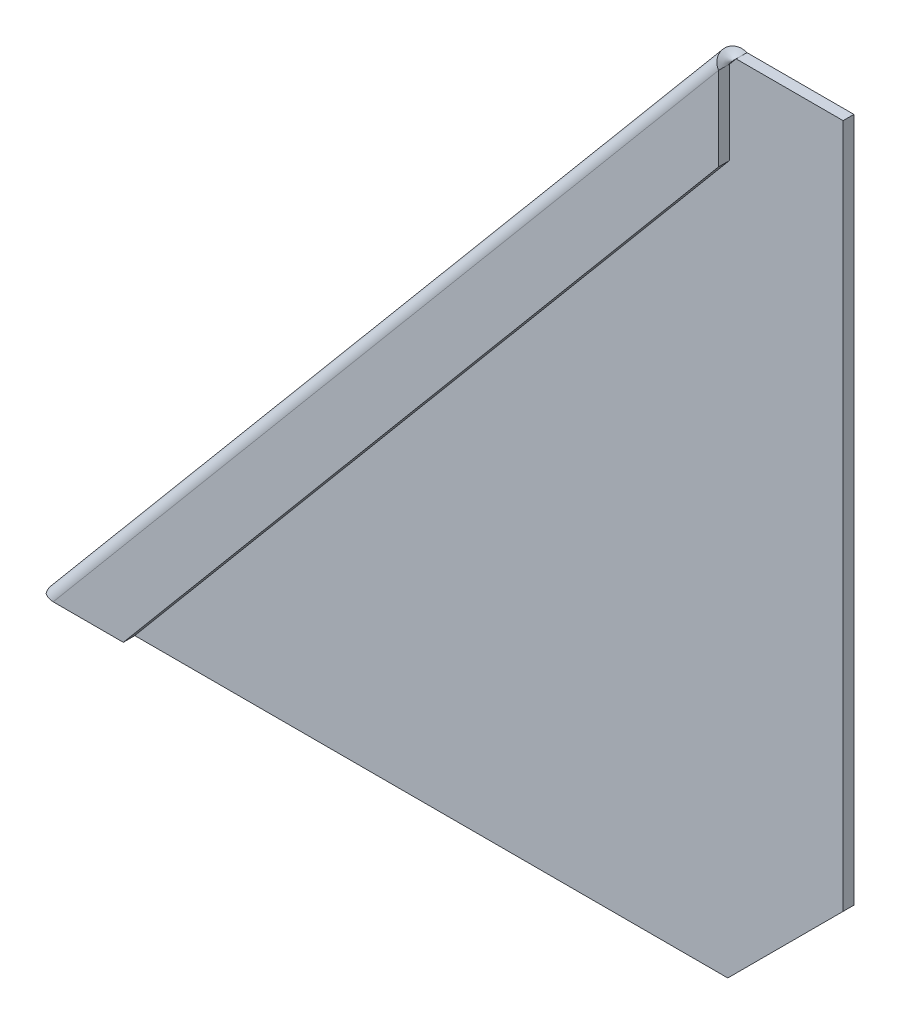
ISO-10303-21;
HEADER;
FILE_DESCRIPTION(('STEP AP214'),'2;1');
FILE_NAME('part.step','',(''),(''),'','','');
FILE_SCHEMA(('AUTOMOTIVE_DESIGN { 1 0 10303 214 1 1 1 1 }'));
ENDSEC;
DATA;
#1=APPLICATION_CONTEXT('core data for automotive mechanical design processes');
#2=APPLICATION_PROTOCOL_DEFINITION('international standard','automotive_design',2000,#1);
#3=PRODUCT_CONTEXT('',#1,'mechanical');
#4=PRODUCT('Part','Part','',(#3));
#5=PRODUCT_RELATED_PRODUCT_CATEGORY('part','',(#4));
#6=PRODUCT_DEFINITION_FORMATION('','',#4);
#7=PRODUCT_DEFINITION_CONTEXT('part definition',#1,'design');
#8=PRODUCT_DEFINITION('design','',#6,#7);
#9=PRODUCT_DEFINITION_SHAPE('','',#8);
#10=(LENGTH_UNIT() NAMED_UNIT(*) SI_UNIT(.MILLI.,.METRE.));
#11=(NAMED_UNIT(*) PLANE_ANGLE_UNIT() SI_UNIT($,.RADIAN.));
#12=(NAMED_UNIT(*) SI_UNIT($,.STERADIAN.) SOLID_ANGLE_UNIT());
#13=UNCERTAINTY_MEASURE_WITH_UNIT(LENGTH_MEASURE(1.E-05),#10,'distance_accuracy_value','');
#14=(GEOMETRIC_REPRESENTATION_CONTEXT(3) GLOBAL_UNCERTAINTY_ASSIGNED_CONTEXT((#13)) GLOBAL_UNIT_ASSIGNED_CONTEXT((#10,
#11,#12)) REPRESENTATION_CONTEXT('',''));
#15=CARTESIAN_POINT('',(0.,0.,0.));
#16=DIRECTION('',(0.,0.,1.));
#17=DIRECTION('',(1.,0.,0.));
#18=AXIS2_PLACEMENT_3D('',#15,#16,#17);
#19=CARTESIAN_POINT('',(53.4644295184103,49.7149115128211,1.6));
#20=DIRECTION('',(-0.766044443118975,0.642787609686543,0.));
#21=DIRECTION('',(-0.642787609686543,-0.766044443118975,0.));
#22=AXIS2_PLACEMENT_3D('',#19,#20,#21);
#23=PLANE('',#22);
#24=DIRECTION('',(0.,0.,1.));
#25=VECTOR('',#24,1.);
#26=CARTESIAN_POINT('',(94.3274279475135,98.4135366948759,-1.60248477930249));
#27=LINE('',#26,#25);
#28=CARTESIAN_POINT('',(94.3274279475135,98.4135366948759,0.1));
#29=VERTEX_POINT('',#28);
#30=CARTESIAN_POINT('',(94.3274279475135,98.4135366948759,1.6));
#31=VERTEX_POINT('',#30);
#32=EDGE_CURVE('E142',#29,#31,#27,.T.);
#33=ORIENTED_EDGE('',*,*,#32,.T.);
#34=DIRECTION('',(-0.642787609686543,-0.766044443118975,0.));
#35=VECTOR('',#34,1.);
#36=CARTESIAN_POINT('',(53.4644295184103,49.7149115128211,1.6));
#37=LINE('',#36,#35);
#38=CARTESIAN_POINT('',(11.7486656039906,0.,1.6));
#39=VERTEX_POINT('',#38);
#40=EDGE_CURVE('E132',#31,#39,#37,.T.);
#41=ORIENTED_EDGE('',*,*,#40,.T.);
#42=DIRECTION('',(0.,0.,1.));
#43=VECTOR('',#42,1.);
#44=CARTESIAN_POINT('',(11.7486656039906,0.,1.6));
#45=LINE('',#44,#43);
#46=CARTESIAN_POINT('',(11.7486656039906,0.,0.0999999999999998));
#47=VERTEX_POINT('',#46);
#48=EDGE_CURVE('E262',#39,#47,#45,.F.);
#49=ORIENTED_EDGE('',*,*,#48,.T.);
#50=DIRECTION('',(-0.642787609686543,-0.766044443118975,0.));
#51=VECTOR('',#50,1.);
#52=CARTESIAN_POINT('',(53.4644295184103,49.7149115128211,0.1));
#53=LINE('',#52,#51);
#54=EDGE_CURVE('E151',#29,#47,#53,.T.);
#55=ORIENTED_EDGE('',*,*,#54,.F.);
#56=EDGE_LOOP('',(#33,#41,#49,#55));
#57=FACE_BOUND('',#56,.T.);
#58=ADVANCED_FACE('F39',(#57),#23,.F.);
#59=CARTESIAN_POINT('',(50.6109139677921,52.1092953589035,1.6));
#60=DIRECTION('',(0.,0.,1.));
#61=DIRECTION('',(1.,0.,0.));
#62=AXIS2_PLACEMENT_3D('',#59,#60,#61);
#63=PLANE('',#62);
#64=DIRECTION('',(0.,-1.,0.));
#65=VECTOR('',#64,1.);
#66=CARTESIAN_POINT('',(94.3274279475135,110.003679204986,1.6));
#67=LINE('',#66,#65);
#68=CARTESIAN_POINT('',(94.3274279475135,110.003679204986,1.6));
#69=VERTEX_POINT('',#68);
#70=EDGE_CURVE('E126',#69,#31,#67,.T.);
#71=ORIENTED_EDGE('',*,*,#70,.F.);
#72=DIRECTION('',(0.642787609686543,0.766044443118975,0.));
#73=VECTOR('',#72,1.);
#74=CARTESIAN_POINT('',(47.757398417174,54.5036792049859,1.6));
#75=LINE('',#74,#73);
#76=CARTESIAN_POINT('',(2.02338129846503,0.,1.6));
#77=VERTEX_POINT('',#76);
#78=EDGE_CURVE('E140',#77,#69,#75,.T.);
#79=ORIENTED_EDGE('',*,*,#78,.F.);
#80=DIRECTION('',(1.,0.,0.));
#81=VECTOR('',#80,1.);
#82=CARTESIAN_POINT('',(11.7486656039906,0.,1.6));
#83=LINE('',#82,#81);
#84=EDGE_CURVE('E259',#77,#39,#83,.T.);
#85=ORIENTED_EDGE('',*,*,#84,.T.);
#86=ORIENTED_EDGE('',*,*,#40,.F.);
#87=EDGE_LOOP('',(#71,#79,#85,#86));
#88=FACE_BOUND('',#87,.T.);
#89=ADVANCED_FACE('F138',(#88),#63,.T.);
#90=CARTESIAN_POINT('',(50.6109139677921,52.1092953589035,0.1));
#91=DIRECTION('',(0.,0.,1.));
#92=DIRECTION('',(1.,0.,0.));
#93=AXIS2_PLACEMENT_3D('',#90,#91,#92);
#94=PLANE('',#93);
#95=DIRECTION('',(0.642787609686543,0.766044443118975,0.));
#96=VECTOR('',#95,1.);
#97=CARTESIAN_POINT('',(47.757398417174,54.5036792049859,0.1));
#98=LINE('',#97,#96);
#99=CARTESIAN_POINT('',(2.02338129846502,0.,0.0999999999999999));
#100=VERTEX_POINT('',#99);
#101=CARTESIAN_POINT('',(94.3274279475135,110.003679204986,0.1));
#102=VERTEX_POINT('',#101);
#103=EDGE_CURVE('E203',#100,#102,#98,.T.);
#104=ORIENTED_EDGE('',*,*,#103,.T.);
#105=DIRECTION('',(0.,1.,0.));
#106=VECTOR('',#105,1.);
#107=CARTESIAN_POINT('',(94.3274279475135,110.003679204986,0.1));
#108=LINE('',#107,#106);
#109=EDGE_CURVE('E141',#29,#102,#108,.T.);
#110=ORIENTED_EDGE('',*,*,#109,.F.);
#111=ORIENTED_EDGE('',*,*,#54,.T.);
#112=DIRECTION('',(1.,0.,0.));
#113=VECTOR('',#112,1.);
#114=CARTESIAN_POINT('',(50.6109139677922,0.,0.0999999999999996));
#115=LINE('',#114,#113);
#116=EDGE_CURVE('E258',#100,#47,#115,.T.);
#117=ORIENTED_EDGE('',*,*,#116,.F.);
#118=EDGE_LOOP('',(#104,#110,#111,#117));
#119=FACE_BOUND('',#118,.T.);
#120=ADVANCED_FACE('F297',(#119),#94,.F.);
#121=CARTESIAN_POINT('',(1.18736888683441,-0.996320795014147,1.615));
#122=CARTESIAN_POINT('',(1.06525189034624,-0.823098008175235,1.615));
#123=CARTESIAN_POINT('',(0.943237636036034,-0.64998547740429,1.57426723898592));
#124=CARTESIAN_POINT('',(0.722935862840768,-0.323645465662352,1.41747569777443));
#125=CARTESIAN_POINT('',(0.624782932955035,-0.17054294084322,1.30147860835318));
#126=CARTESIAN_POINT('',(0.472517606615515,0.0987077134354483,1.0117656167608));
#127=CARTESIAN_POINT('',(0.418492531330992,0.214782571734061,0.838163704280529));
#128=CARTESIAN_POINT('',(0.368050943427069,0.398592964646326,0.459635439022373));
#129=CARTESIAN_POINT('',(0.371681688683938,0.466288845193432,0.254858020952946));
#130=CARTESIAN_POINT('',(0.44134938965313,0.549315578111301,-0.154858020952702));
#131=CARTESIAN_POINT('',(0.507386345365461,0.564646430482059,-0.359635439022135));
#132=CARTESIAN_POINT('',(0.697163335207776,0.546889503405524,-0.738163704280317));
#133=CARTESIAN_POINT('',(0.820856111461497,0.513841378024773,-0.911765616760599));
#134=CARTESIAN_POINT('',(1.11245683973942,0.410644189581829,-1.20147860835303));
#135=CARTESIAN_POINT('',(1.28027747059436,0.340568397680551,-1.31747569777431));
#136=CARTESIAN_POINT('',(1.63991464572805,0.180281851774321,-1.47426723898586));
#137=CARTESIAN_POINT('',(1.83158476108518,0.090181943651314,-1.51499999999997));
#138=CARTESIAN_POINT('',(2.02338129846486,1.58081334632056E-13,-1.515));
#139=CARTESIAN_POINT('',(1.18736888683441,-0.996320795014147,1.6));
#140=CARTESIAN_POINT('',(1.06675621881271,-0.824360406856436,1.6));
#141=CARTESIAN_POINT('',(0.946245293720707,-0.652509201858207,1.55965764883589));
#142=CARTESIAN_POINT('',(0.728722780661203,-0.328501266271132,1.40436890194912));
#143=CARTESIAN_POINT('',(0.631844484453141,-0.17646828610082,1.28948360571721));
#144=CARTESIAN_POINT('',(0.481706311729999,0.0909974743628879,1.00254741596118));
#145=CARTESIAN_POINT('',(0.428532919440068,0.206357685774858,0.830609419574965));
#146=CARTESIAN_POINT('',(0.379242538777741,0.389202101115292,0.455709220756983));
#147=CARTESIAN_POINT('',(0.383172355330722,0.456647031048134,0.252894525544452));
#148=CARTESIAN_POINT('',(0.452840056299914,0.539673763966003,-0.15289452554421));
#149=CARTESIAN_POINT('',(0.518577940716134,0.555255566951024,-0.355709220756747));
#150=CARTESIAN_POINT('',(0.707203723316854,0.53846461744632,-0.730609419574755));
#151=CARTESIAN_POINT('',(0.830044816575982,0.506131138952212,-0.902547415960976));
#152=CARTESIAN_POINT('',(1.11951839123753,0.404718844324228,-1.18948360571706));
#153=CARTESIAN_POINT('',(1.2860643884148,0.335712597071769,-1.30436890194899));
#154=CARTESIAN_POINT('',(1.64292230341272,0.177758127320403,-1.45965764883583));
#155=CARTESIAN_POINT('',(1.83308920499064,0.0889196825449384,-1.49999999999997));
#156=CARTESIAN_POINT('',(2.02338129846486,1.56585135634026E-13,-1.5));
#157=CARTESIAN_POINT('',(1.18736888683441,-0.996320795014147,0.1));
#158=CARTESIAN_POINT('',(1.2171890654594,-0.950600274976489,0.1));
#159=CARTESIAN_POINT('',(1.24701106218805,-0.904881647249911,0.098698633833416));
#160=CARTESIAN_POINT('',(1.30741456270473,-0.814081327149187,0.0936893194177136));
#161=CARTESIAN_POINT('',(1.33799963426377,-0.769002811860864,0.08998334211991));
#162=CARTESIAN_POINT('',(1.4005768231784,-0.680026432893152,0.0807273359987476));
#163=CARTESIAN_POINT('',(1.4325717303477,-0.636130910145421,0.0751809490185473));
#164=CARTESIAN_POINT('',(1.49840207384494,-0.549884251988137,0.0630873942179672));
#165=CARTESIAN_POINT('',(1.53223902000917,-0.507534383481668,0.0565449846949823));
#166=CARTESIAN_POINT('',(1.60190672097839,-0.424507650563822,0.0434550153050255));
#167=CARTESIAN_POINT('',(1.63773747578338,-0.383830786152444,0.0369126057820405));
#168=CARTESIAN_POINT('',(1.71124253422458,-0.304023978474036,0.0248190509814596));
#169=CARTESIAN_POINT('',(1.7489153280245,-0.26489276830392,0.0192726640012587));
#170=CARTESIAN_POINT('',(1.82567354104831,-0.18781568143594,0.0100166578800948));
#171=CARTESIAN_POINT('',(1.86475617045849,-0.149867463806417,0.00631068058229042));
#172=CARTESIAN_POINT('',(1.94368807188024,-0.0746143180714487,0.00130136616658613));
#173=CARTESIAN_POINT('',(1.98353359553614,-0.0373064280926161,0.));
#174=CARTESIAN_POINT('',(2.02338129846504,0.,0.));
#175=B_SPLINE_SURFACE_WITH_KNOTS('',1,3,((#121,#122,#123,#124,#125,#126,#127,#128,#129,#130,
#131,#132,#133,#134,#135,#136,#137,#138),(#139,#140,#141,#142,#143,#144,#145,#146,#147,#148,
#149,#150,#151,#152,#153,#154,#155,#156),(#157,#158,#159,#160,#161,#162,#163,#164,#165,#166,
#167,#168,#169,#170,#171,#172,#173,#174)),.UNSPECIFIED.,.F.,.F.,.F.,(2,1,2),(4,2,2,2,2,2,2,2,4),
(-0.01,0.,1.),(0.,0.125,0.25,0.375,0.5,0.625,0.75,0.875,1.),.UNSPECIFIED.);
#176=CARTESIAN_POINT('',(1.18736888683441,-0.996320795014147,0.1));
#177=CARTESIAN_POINT('',(1.21716880831438,-0.950583460584059,0.100065775890201));
#178=CARTESIAN_POINT('',(1.24700485282516,-0.904876436975799,0.0987159274405331));
#179=CARTESIAN_POINT('',(1.30742077206762,-0.814086537423298,0.0936720258105964));
#180=CARTESIAN_POINT('',(1.33800064679931,-0.769003661479057,0.089977972630328));
#181=CARTESIAN_POINT('',(1.40057581064287,-0.680025583274959,0.0807327054883296));
#182=CARTESIAN_POINT('',(1.43257109975474,-0.636130381015102,0.0751814915265998));
#183=CARTESIAN_POINT('',(1.4984027044379,-0.549884781118456,0.0630868517099146));
#184=CARTESIAN_POINT('',(1.53223902000917,-0.507534383481668,0.0565434258549593));
#185=CARTESIAN_POINT('',(1.60190672097839,-0.424507650563822,0.0434565741450485));
#186=CARTESIAN_POINT('',(1.63773810637633,-0.383831315282764,0.036913148290093));
#187=CARTESIAN_POINT('',(1.71124190363162,-0.304023449343716,0.0248185084734071));
#188=CARTESIAN_POINT('',(1.74891431548896,-0.264891918685727,0.0192672945116766));
#189=CARTESIAN_POINT('',(1.82567455358384,-0.187816531054133,0.0100220273696769));
#190=CARTESIAN_POINT('',(1.86476237982138,-0.149872674080528,0.00632797418940756));
#191=CARTESIAN_POINT('',(1.94368186251735,-0.0746091077973372,0.00128407255946899));
#192=CARTESIAN_POINT('',(1.98351351897579,-0.0372893984877515,-6.57758902002627E-05));
#193=CARTESIAN_POINT('',(2.02338129846504,0.,0.));
#194=B_SPLINE_CURVE_WITH_KNOTS('',3,(#176,#177,#178,#179,#180,#181,#182,#183,#184,#185,#186,
#187,#188,#189,#190,#191,#192,#193),.UNSPECIFIED.,.F.,.F.,(4,2,2,2,2,2,2,2,4),(0.,
0.16374190956037,0.327483819120739,0.491225728681109,0.654967638241479,0.818709547801848,
0.982451457362218,1.14619336692259,1.30993527648296),.UNSPECIFIED.);
#195=CARTESIAN_POINT('',(1.3794621678111,-0.71010461708493,0.0838227237777744));
#196=VERTEX_POINT('',#195);
#197=CARTESIAN_POINT('',(2.02338129846505,0.,0.));
#198=VERTEX_POINT('',#197);
#199=EDGE_CURVE('E194',#196,#198,#194,.T.);
#200=DIRECTION('',(-0.564179819018901,0.47340307805643,0.67645447555508));
#201=VECTOR('',#200,1.);
#202=CARTESIAN_POINT('',(0.952095954904266,-0.35150178545685,0.596236989010723));
#203=LINE('',#202,#201);
#204=CARTESIAN_POINT('',(0.533192439282753,0.,1.09850443711034));
#205=VERTEX_POINT('',#204);
#206=EDGE_CURVE('E58',#196,#205,#203,.T.);
#207=CARTESIAN_POINT('',(1.18736888683441,-0.996320795014147,1.6));
#208=CARTESIAN_POINT('',(1.15941476798433,-0.956464135635271,1.59999971308944));
#209=CARTESIAN_POINT('',(1.13147488079028,-0.916629199740768,1.59785762616922));
#210=CARTESIAN_POINT('',(1.07589293205603,-0.837210384803298,1.58931558930324));
#211=CARTESIAN_POINT('',(1.0482508633581,-0.797626499736061,1.58291574192088));
#212=CARTESIAN_POINT('',(0.96629097710458,-0.679729094786784,1.55740461058176));
#213=CARTESIAN_POINT('',(0.912817023843812,-0.602096742933984,1.53198147631382));
#214=CARTESIAN_POINT('',(0.812572985790885,-0.453759036578622,1.46645399527575));
#215=CARTESIAN_POINT('',(0.765622659865016,-0.382901565405351,1.42696170206043));
#216=CARTESIAN_POINT('',(0.677929641163344,-0.246401544498451,1.33442145284099));
#217=CARTESIAN_POINT('',(0.637185206257785,-0.180757533717667,1.28137731237403));
#218=CARTESIAN_POINT('',(0.563615032985721,-0.0561103216146183,1.16334252457802));
#219=CARTESIAN_POINT('',(0.530789540056217,0.00289267384804367,1.0983515070815));
#220=CARTESIAN_POINT('',(0.474514283332714,0.113032702330246,0.958386142075318));
#221=CARTESIAN_POINT('',(0.451066211442278,0.164168314868909,0.883409996267558));
#222=CARTESIAN_POINT('',(0.4147466558964,0.25756749023924,0.725771029705138));
#223=CARTESIAN_POINT('',(0.401874558277994,0.299831567980636,0.64310865546631));
#224=CARTESIAN_POINT('',(0.387562983878634,0.374760752554453,0.472612382017508));
#225=CARTESIAN_POINT('',(0.38612275950006,0.40742648694462,0.384778821360362));
#226=CARTESIAN_POINT('',(0.395191655751465,0.462734777179185,0.20660554292085));
#227=CARTESIAN_POINT('',(0.405701140238716,0.485377027788866,0.116265748907778));
#228=CARTESIAN_POINT('',(0.438819702907601,0.520507860795771,-0.064170124234897));
#229=CARTESIAN_POINT('',(0.461428808451371,0.532996420231231,-0.154266202812897));
#230=CARTESIAN_POINT('',(0.518529639915988,0.548001446893185,-0.331470939227272));
#231=CARTESIAN_POINT('',(0.553021020469335,0.550518203931239,-0.41857968381191));
#232=CARTESIAN_POINT('',(0.63331162793968,0.546066881211348,-0.587166947608949));
#233=CARTESIAN_POINT('',(0.679111470171613,0.539098285244141,-0.668645160144515));
#234=CARTESIAN_POINT('',(0.781096200650439,0.516445018915251,-0.823491481301547));
#235=CARTESIAN_POINT('',(0.837281520131974,0.500759986567982,-0.89685925295214));
#236=CARTESIAN_POINT('',(0.958791887855717,0.461720666548431,-1.0332379839442));
#237=CARTESIAN_POINT('',(1.02411568034802,0.438367431997972,-1.09625036367387));
#238=CARTESIAN_POINT('',(1.16239225909434,0.385255448135228,-1.21001564554101));
#239=CARTESIAN_POINT('',(1.23534509652128,0.355496655855318,-1.26076846543815));
#240=CARTESIAN_POINT('',(1.38713634769567,0.291046644652834,-1.34847454455524));
#241=CARTESIAN_POINT('',(1.46597549960096,0.256354806619502,-1.38542606956062));
#242=CARTESIAN_POINT('',(1.62382815810242,0.18534968120767,-1.4430102666123));
#243=CARTESIAN_POINT('',(1.70265886710051,0.149189524044041,-1.4643290556288));
#244=CARTESIAN_POINT('',(1.82221184480131,0.0938319743023065,-1.48570209712041));
#245=CARTESIAN_POINT('',(1.86230351856722,0.0751824606673523,-1.49105894436943));
#246=CARTESIAN_POINT('',(1.94271814956082,0.0376911654979252,-1.49820813543985));
#247=CARTESIAN_POINT('',(1.98304112523137,0.0188493685357221,-1.50000019094614));
#248=CARTESIAN_POINT('',(2.02338129846486,1.56585135634026E-13,-1.5));
#249=B_SPLINE_CURVE_WITH_KNOTS('',3,(#207,#208,#209,#210,#211,#212,#213,#214,#215,#216,#217,
#218,#219,#220,#221,#222,#223,#224,#225,#226,#227,#228,#229,#230,#231,#232,#233,#234,#235,#236,
#237,#238,#239,#240,#241,#242,#243,#244,#245,#246,#247,#248),.UNSPECIFIED.,.F.,.F.,(4,2,2,2,2,2,
2,2,2,2,2,2,2,2,2,2,2,2,2,2,4),(0.,0.145948887948322,0.291894260322407,0.583157694214587,
0.863047563537065,1.14285871624387,1.42267854020877,1.70254882738755,1.98240286621607,
2.26223860358758,2.5420828619194,2.82192775309496,3.10176451104882,3.38161649881036,
3.66148010943616,3.94130530071905,4.2211323690904,4.50099458757257,4.76768679063459,
4.90118278071994,5.03468956732584),.UNSPECIFIED.);
#250=CARTESIAN_POINT('',(2.02338129846505,0.,-1.5));
#251=VERTEX_POINT('',#250);
#252=EDGE_CURVE('E65',#205,#251,#249,.T.);
#253=DIRECTION('',(-1.49772966992418E-13,1.25674441363666E-13,-1.));
#254=VECTOR('',#253,1.);
#255=CARTESIAN_POINT('',(2.02338129846504,0.,0.));
#256=LINE('',#255,#254);
#257=EDGE_CURVE('E158',#198,#251,#256,.T.);
#258=ORIENTED_EDGE('',*,*,#199,.F.);
#259=ORIENTED_EDGE('',*,*,#206,.T.);
#260=ORIENTED_EDGE('',*,*,#252,.T.);
#261=ORIENTED_EDGE('',*,*,#257,.F.);
#262=EDGE_LOOP('',(#258,#259,#260,#261));
#263=FACE_BOUND('',#262,.T.);
#264=ADVANCED_FACE('F185',(#263),#175,.F.);
#265=CARTESIAN_POINT('',(1.18736888683441,-0.996320795014147,0.05));
#266=DIRECTION('',(-0.642787609686543,-0.766044443118975,0.));
#267=DIRECTION('',(0.,0.,1.));
#268=AXIS2_PLACEMENT_3D('',#265,#266,#267);
#269=CYLINDRICAL_SURFACE('',#268,1.55);
#270=ORIENTED_EDGE('',*,*,#252,.F.);
#271=CARTESIAN_POINT('',(0.533192439282686,0.,1.09850443711042));
#272=CARTESIAN_POINT('',(0.581192019908546,0.00659518528979246,1.1339318719205));
#273=CARTESIAN_POINT('',(0.63046126397529,0.0121238884435424,1.167835289511));
#274=CARTESIAN_POINT('',(0.731308594351757,0.021252705379318,1.23233019725133));
#275=CARTESIAN_POINT('',(0.782887195859991,0.0248523864661467,1.26292094311538));
#276=CARTESIAN_POINT('',(0.887956345392533,0.0303172344491652,1.32043129823248));
#277=CARTESIAN_POINT('',(0.941441245461794,0.0321871440672115,1.34736077183084));
#278=CARTESIAN_POINT('',(1.05017417383933,0.0344352538465232,1.39740757189178));
#279=CARTESIAN_POINT('',(1.10542167890793,0.0348138926221636,1.42052601734148));
#280=CARTESIAN_POINT('',(1.22904946894692,0.0342575153375243,1.46714675754487));
#281=CARTESIAN_POINT('',(1.2977761907363,0.0330336334628605,1.48973343476685));
#282=CARTESIAN_POINT('',(1.43687984897719,0.0291761565526624,1.52878073872201));
#283=CARTESIAN_POINT('',(1.50725621086338,0.0265430455717221,1.54524346567502));
#284=CARTESIAN_POINT('',(1.65155791781921,0.0202100363518141,1.57229425123314));
#285=CARTESIAN_POINT('',(1.72552274878751,0.0164770383310525,1.58266454088114));
#286=CARTESIAN_POINT('',(1.87411820133748,0.00849577448107816,1.59652846015103));
#287=CARTESIAN_POINT('',(1.94874925031606,0.0042471519820581,1.60001730059705));
#288=CARTESIAN_POINT('',(2.02338129846506,0.,1.6));
#289=B_SPLINE_CURVE_WITH_KNOTS('',3,(#271,#272,#273,#274,#275,#276,#277,#278,#279,#280,#281,
#282,#283,#284,#285,#286,#287,#288),.UNSPECIFIED.,.F.,.F.,(4,2,2,2,2,2,2,2,4),(0.,
0.180020282607949,0.360080928332126,0.53964640408614,0.719159061880484,0.935918114861783,
1.1526027612485,1.37662367321431,1.60080043861841),.UNSPECIFIED.);
#290=EDGE_CURVE('E150',#205,#77,#289,.T.);
#291=ORIENTED_EDGE('',*,*,#290,.T.);
#292=ORIENTED_EDGE('',*,*,#78,.T.);
#293=CARTESIAN_POINT('',(95.1634403591441,111.,-1.5));
#294=CARTESIAN_POINT('',(95.1193350301824,111.020608396703,-1.49999971308944));
#295=CARTESIAN_POINT('',(95.0752535659775,111.041206550204,-1.49785762616925));
#296=CARTESIAN_POINT('',(94.9873895971837,111.082153151759,-1.48931558930337));
#297=CARTESIAN_POINT('',(94.943607085419,111.102501605815,-1.48291574192109));
#298=CARTESIAN_POINT('',(94.813268622076,111.162743667712,-1.45740461058228));
#299=CARTESIAN_POINT('',(94.7275300255509,111.20192451504,-1.43198147631465));
#300=CARTESIAN_POINT('',(94.5640387077386,111.274887048519,-1.36645399527717));
#301=CARTESIAN_POINT('',(94.4861048822304,111.308819822754,-1.32696170206202));
#302=CARTESIAN_POINT('',(94.3364508704632,111.371477607575,-1.23442145284293));
#303=CARTESIAN_POINT('',(94.2647289428359,111.400204080115,-1.18137731237613));
#304=CARTESIAN_POINT('',(94.129200075446,111.451011795911,-1.06334252458044));
#305=CARTESIAN_POINT('',(94.0653933810351,111.473092833206,-0.998351507084057));
#306=CARTESIAN_POINT('',(93.9471545312908,111.509387527096,-0.858386142078131));
#307=CARTESIAN_POINT('',(93.892724068654,111.523599764156,-0.783409996270484));
#308=CARTESIAN_POINT('',(93.7944370119899,111.543148947445,-0.62577102970827));
#309=CARTESIAN_POINT('',(93.7505798042619,111.548486408897,-0.543108655469533));
#310=CARTESIAN_POINT('',(93.6743037835524,111.549569241968,-0.372612382020862));
#311=CARTESIAN_POINT('',(93.6418842227282,111.545315240853,-0.284778821363755));
#312=CARTESIAN_POINT('',(93.5889909870066,111.526779937705,-0.106605542924295));
#313=CARTESIAN_POINT('',(93.5685176758899,111.512498330345,-0.0162657489112341));
#314=CARTESIAN_POINT('',(93.539671537229,111.473782507929,0.164170124231445));
#315=CARTESIAN_POINT('',(93.5312987370492,111.449348269913,0.254266202809462));
#316=CARTESIAN_POINT('',(93.5264371257851,111.390509332848,0.431470939223913));
#317=CARTESIAN_POINT('',(93.5299479693197,111.356104923594,0.51857968380861));
#318=CARTESIAN_POINT('',(93.5482739841162,111.277807074941,0.687166947605795));
#319=CARTESIAN_POINT('',(93.5630897705932,111.233913119215,0.768645160141449));
#320=CARTESIAN_POINT('',(93.6031083455022,111.137411464367,0.923491481298686));
#321=CARTESIAN_POINT('',(93.6283115653035,111.08480340342,0.996859252949398));
#322=CARTESIAN_POINT('',(93.6878578442537,110.971918157994,1.13323798394172));
#323=CARTESIAN_POINT('',(93.7221996482213,110.911642027314,1.19625036367152));
#324=CARTESIAN_POINT('',(93.7985162176203,110.784688979714,1.31001564553898));
#325=CARTESIAN_POINT('',(93.8404910342526,110.718012019861,1.3607684654363));
#326=CARTESIAN_POINT('',(93.9303201791187,110.579718445861,1.44847454455374));
#327=CARTESIAN_POINT('',(93.9781752452372,110.508101212278,1.4854260695593));
#328=CARTESIAN_POINT('',(94.0755124697353,110.364976600985,1.54301026661158));
#329=CARTESIAN_POINT('',(94.1248120818223,110.293622652983,1.56432905562839));
#330=CARTESIAN_POINT('',(94.2000887827088,110.18549869128,1.58570209712029));
#331=CARTESIAN_POINT('',(94.2254168144157,110.149254554181,1.59105894436937));
#332=CARTESIAN_POINT('',(94.2763023866992,110.076571897206,1.59820813543987));
#333=CARTESIAN_POINT('',(94.3018599456718,110.040133361848,1.60000019094616));
#334=CARTESIAN_POINT('',(94.327427947514,110.003679204985,1.6));
#335=B_SPLINE_CURVE_WITH_KNOTS('',3,(#293,#294,#295,#296,#297,#298,#299,#300,#301,#302,#303,
#304,#305,#306,#307,#308,#309,#310,#311,#312,#313,#314,#315,#316,#317,#318,#319,#320,#321,#322,
#323,#324,#325,#326,#327,#328,#329,#330,#331,#332,#333,#334),.UNSPECIFIED.,.F.,.F.,(4,2,2,2,2,2,
2,2,2,2,2,2,2,2,2,2,2,2,2,2,4),(0.,0.14594888794743,0.29189426032062,0.583157694211031,
0.863047563533527,1.14285871624031,1.4226785402052,1.70254882738396,1.98240286621249,
2.262238603584,2.54208286191581,2.82192775309137,3.10176451104524,3.38161649880678,
3.66148010943257,3.94130530071544,4.22113236908679,4.50099458756896,4.76768679063319,
4.90118278071966,5.03468956732666),.UNSPECIFIED.);
#336=CARTESIAN_POINT('',(95.163440359144,111.,-1.5));
#337=VERTEX_POINT('',#336);
#338=EDGE_CURVE('E149',#337,#69,#335,.T.);
#339=ORIENTED_EDGE('',*,*,#338,.F.);
#340=DIRECTION('',(-0.642787609686543,-0.766044443118975,0.));
#341=VECTOR('',#340,1.);
#342=CARTESIAN_POINT('',(1.18736888683425,-0.996320795014009,-1.5));
#343=LINE('',#342,#341);
#344=EDGE_CURVE('E159',#251,#337,#343,.F.);
#345=ORIENTED_EDGE('',*,*,#344,.F.);
#346=EDGE_LOOP('',(#270,#291,#292,#339,#345));
#347=FACE_BOUND('',#346,.T.);
#348=ADVANCED_FACE('F147',(#347),#269,.T.);
#349=CARTESIAN_POINT('',(1.18736888683441,-0.996320795014147,0.05));
#350=DIRECTION('',(-0.642787609686543,-0.766044443118975,0.));
#351=DIRECTION('',(0.,0.,1.));
#352=AXIS2_PLACEMENT_3D('',#349,#350,#351);
#353=CYLINDRICAL_SURFACE('',#352,0.05);
#354=CARTESIAN_POINT('',(1.37946216781117,-0.71010461708467,0.0838227237776491));
#355=CARTESIAN_POINT('',(1.40601031444282,-0.68028045204321,0.0850931984389044));
#356=CARTESIAN_POINT('',(1.4326091541581,-0.650498823549535,0.0863028086490816));
#357=CARTESIAN_POINT('',(1.48589735340459,-0.591011521706341,0.0885884849516076));
#358=CARTESIAN_POINT('',(1.5125867129358,-0.561305848356822,0.0896645510439564));
#359=CARTESIAN_POINT('',(1.56604508546278,-0.501961338850524,0.0916713238951531));
#360=CARTESIAN_POINT('',(1.59281409845856,-0.472322502693746,0.092602030654001));
#361=CARTESIAN_POINT('',(1.64641979965283,-0.413101616617836,0.0943082101035943));
#362=CARTESIAN_POINT('',(1.67325648785133,-0.383519566698702,0.0950836827943397));
#363=CARTESIAN_POINT('',(1.72698490743544,-0.32440165357844,0.0964710679167235));
#364=CARTESIAN_POINT('',(1.75387663882105,-0.294865790377312,0.0970829803483618));
#365=CARTESIAN_POINT('',(1.80770190232695,-0.235829138956108,0.0981367326681953));
#366=CARTESIAN_POINT('',(1.83463543444724,-0.206328350736034,0.0985785725563904));
#367=CARTESIAN_POINT('',(1.8885306255477,-0.147350375533626,0.0992873435510736));
#368=CARTESIAN_POINT('',(1.91549228452785,-0.117873188551292,0.0995542746575617));
#369=CARTESIAN_POINT('',(1.96942971284979,-0.058930654585855,0.0999107735019461));
#370=CARTESIAN_POINT('',(1.99640548219157,-0.0294653076027522,0.100000341239842));
#371=CARTESIAN_POINT('',(2.02338129846504,0.,0.1));
#372=B_SPLINE_CURVE_WITH_KNOTS('',3,(#354,#355,#356,#357,#358,#359,#360,#361,#362,#363,#364,
#365,#366,#367,#368,#369,#370,#371),.UNSPECIFIED.,.F.,.F.,(4,2,2,2,2,2,2,2,4),(0.,
0.119846010347673,0.239692020695346,0.35953803104302,0.479384041390693,0.599230051738367,
0.71907606208604,0.838922072433713,0.958768082781386),.UNSPECIFIED.);
#373=EDGE_CURVE('E261',#196,#100,#372,.T.);
#374=ORIENTED_EDGE('',*,*,#373,.F.);
#375=ORIENTED_EDGE('',*,*,#199,.T.);
#376=DIRECTION('',(-0.642787609686543,-0.766044443118975,0.));
#377=VECTOR('',#376,1.);
#378=CARTESIAN_POINT('',(1.18736888683441,-0.996320795014142,0.));
#379=LINE('',#378,#377);
#380=CARTESIAN_POINT('',(95.1634403591442,111.,0.));
#381=VERTEX_POINT('',#380);
#382=EDGE_CURVE('E196',#198,#381,#379,.F.);
#383=ORIENTED_EDGE('',*,*,#382,.T.);
#384=CARTESIAN_POINT('',(95.1634403591441,111.,0.));
#385=CARTESIAN_POINT('',(95.1235725796549,110.962710601512,-6.57758902000603E-05));
#386=CARTESIAN_POINT('',(95.0837409231964,110.925390892203,0.00128407255946809));
#387=CARTESIAN_POINT('',(95.0048214405005,110.850127325919,0.00632797418940491));
#388=CARTESIAN_POINT('',(94.9657336142629,110.812183468946,0.0100220273696739));
#389=CARTESIAN_POINT('',(94.888973376168,110.735108081314,0.0192672945116751));
#390=CARTESIAN_POINT('',(94.8513009643107,110.695976550656,0.0248185084734067));
#391=CARTESIAN_POINT('',(94.7777971670554,110.616168684717,0.0369131482900946));
#392=CARTESIAN_POINT('',(94.7419657816575,110.575492349436,0.043456574145051));
#393=CARTESIAN_POINT('',(94.6722980806883,110.492465616518,0.0565434258549631));
#394=CARTESIAN_POINT('',(94.638461765117,110.450115218882,0.0630868517099189));
#395=CARTESIAN_POINT('',(94.5726301604338,110.363869618985,0.0751814915266052));
#396=CARTESIAN_POINT('',(94.540634871322,110.319974416725,0.0807327054883359));
#397=CARTESIAN_POINT('',(94.4780597074784,110.230996338521,0.0899779726303345));
#398=CARTESIAN_POINT('',(94.4474798327467,110.185913462577,0.093672025810602));
#399=CARTESIAN_POINT('',(94.3870639135042,110.095123563024,0.0987159274405359));
#400=CARTESIAN_POINT('',(94.3572278689935,110.049416539416,0.100065775890202));
#401=CARTESIAN_POINT('',(94.3274279475135,110.003679204986,0.1));
#402=B_SPLINE_CURVE_WITH_KNOTS('',3,(#384,#385,#386,#387,#388,#389,#390,#391,#392,#393,#394,
#395,#396,#397,#398,#399,#400,#401),.UNSPECIFIED.,.F.,.F.,(4,2,2,2,2,2,2,2,4),(0.,
0.163741909560372,0.327483819120766,0.491225728681118,0.654967638241489,0.818709547801866,
0.982451457362216,1.1461933669226,1.30993527648298),.UNSPECIFIED.);
#403=EDGE_CURVE('E218',#381,#102,#402,.T.);
#404=ORIENTED_EDGE('',*,*,#403,.T.);
#405=ORIENTED_EDGE('',*,*,#103,.F.);
#406=EDGE_LOOP('',(#374,#375,#383,#404,#405));
#407=FACE_BOUND('',#406,.T.);
#408=ADVANCED_FACE('F184',(#407),#353,.F.);
#409=CARTESIAN_POINT('',(94.,0.,-1.5));
#410=DIRECTION('',(0.,-1.,0.));
#411=DIRECTION('',(1.,0.,0.));
#412=AXIS2_PLACEMENT_3D('',#409,#410,#411);
#413=PLANE('',#412);
#414=DIRECTION('',(1.,0.,0.));
#415=VECTOR('',#414,1.);
#416=CARTESIAN_POINT('',(94.,0.,0.));
#417=LINE('',#416,#415);
#418=CARTESIAN_POINT('',(94.,0.,0.));
#419=VERTEX_POINT('',#418);
#420=EDGE_CURVE('E217',#198,#419,#417,.T.);
#421=ORIENTED_EDGE('',*,*,#420,.F.);
#422=ORIENTED_EDGE('',*,*,#257,.T.);
#423=DIRECTION('',(1.,0.,0.));
#424=VECTOR('',#423,1.);
#425=CARTESIAN_POINT('',(94.,0.,-1.5));
#426=LINE('',#425,#424);
#427=CARTESIAN_POINT('',(94.,0.,-1.5));
#428=VERTEX_POINT('',#427);
#429=EDGE_CURVE('E221',#251,#428,#426,.T.);
#430=ORIENTED_EDGE('',*,*,#429,.T.);
#431=DIRECTION('',(0.,0.,1.));
#432=VECTOR('',#431,1.);
#433=CARTESIAN_POINT('',(94.,0.,-1.5));
#434=LINE('',#433,#432);
#435=EDGE_CURVE('E213',#428,#419,#434,.T.);
#436=ORIENTED_EDGE('',*,*,#435,.T.);
#437=EDGE_LOOP('',(#421,#422,#430,#436));
#438=FACE_BOUND('',#437,.T.);
#439=ADVANCED_FACE('F41',(#438),#413,.T.);
#440=CARTESIAN_POINT('',(93.1400590606791,111.,-1.5));
#441=DIRECTION('',(0.,1.,0.));
#442=DIRECTION('',(0.,0.,1.));
#443=AXIS2_PLACEMENT_3D('',#440,#441,#442);
#444=PLANE('',#443);
#445=DIRECTION('',(-1.49772966992418E-13,1.25674441363666E-13,-1.));
#446=VECTOR('',#445,1.);
#447=CARTESIAN_POINT('',(95.1634403591443,111.,0.));
#448=LINE('',#447,#446);
#449=EDGE_CURVE('E157',#381,#337,#448,.T.);
#450=ORIENTED_EDGE('',*,*,#449,.F.);
#451=DIRECTION('',(-1.,0.,0.));
#452=VECTOR('',#451,1.);
#453=CARTESIAN_POINT('',(93.1400590606791,111.,0.));
#454=LINE('',#453,#452);
#455=CARTESIAN_POINT('',(110.,111.,0.));
#456=VERTEX_POINT('',#455);
#457=EDGE_CURVE('E224',#456,#381,#454,.T.);
#458=ORIENTED_EDGE('',*,*,#457,.F.);
#459=DIRECTION('',(0.,0.,1.));
#460=VECTOR('',#459,1.);
#461=CARTESIAN_POINT('',(110.,111.,-1.5));
#462=LINE('',#461,#460);
#463=CARTESIAN_POINT('',(110.,111.,-1.5));
#464=VERTEX_POINT('',#463);
#465=EDGE_CURVE('E11',#464,#456,#462,.T.);
#466=ORIENTED_EDGE('',*,*,#465,.F.);
#467=DIRECTION('',(-1.,0.,0.));
#468=VECTOR('',#467,1.);
#469=CARTESIAN_POINT('',(93.1400590606791,111.,-1.5));
#470=LINE('',#469,#468);
#471=EDGE_CURVE('E230',#464,#337,#470,.T.);
#472=ORIENTED_EDGE('',*,*,#471,.T.);
#473=EDGE_LOOP('',(#450,#458,#466,#472));
#474=FACE_BOUND('',#473,.T.);
#475=ADVANCED_FACE('F307',(#474),#444,.T.);
#476=CARTESIAN_POINT('',(110.,111.,-1.5));
#477=DIRECTION('',(1.,0.,0.));
#478=DIRECTION('',(0.,1.,0.));
#479=AXIS2_PLACEMENT_3D('',#476,#477,#478);
#480=PLANE('',#479);
#481=DIRECTION('',(0.,1.,0.));
#482=VECTOR('',#481,1.);
#483=CARTESIAN_POINT('',(110.,111.,0.));
#484=LINE('',#483,#482);
#485=CARTESIAN_POINT('',(110.,15.9999999999998,0.));
#486=VERTEX_POINT('',#485);
#487=EDGE_CURVE('E236',#486,#456,#484,.T.);
#488=ORIENTED_EDGE('',*,*,#487,.F.);
#489=DIRECTION('',(0.,0.,1.));
#490=VECTOR('',#489,1.);
#491=CARTESIAN_POINT('',(110.,15.9999999999998,-1.5));
#492=LINE('',#491,#490);
#493=CARTESIAN_POINT('',(110.,15.9999999999998,-1.5));
#494=VERTEX_POINT('',#493);
#495=EDGE_CURVE('E50',#494,#486,#492,.T.);
#496=ORIENTED_EDGE('',*,*,#495,.F.);
#497=DIRECTION('',(0.,1.,0.));
#498=VECTOR('',#497,1.);
#499=CARTESIAN_POINT('',(110.,111.,-1.5));
#500=LINE('',#499,#498);
#501=EDGE_CURVE('E227',#494,#464,#500,.T.);
#502=ORIENTED_EDGE('',*,*,#501,.T.);
#503=ORIENTED_EDGE('',*,*,#465,.T.);
#504=EDGE_LOOP('',(#488,#496,#502,#503));
#505=FACE_BOUND('',#504,.T.);
#506=ADVANCED_FACE('F310',(#505),#480,.T.);
#507=CARTESIAN_POINT('',(110.,15.9999999999998,-1.5));
#508=DIRECTION('',(0.707106781186544,-0.707106781186551,0.));
#509=DIRECTION('',(0.707106781186551,0.707106781186544,0.));
#510=AXIS2_PLACEMENT_3D('',#507,#508,#509);
#511=PLANE('',#510);
#512=DIRECTION('',(0.707106781186551,0.707106781186544,0.));
#513=VECTOR('',#512,1.);
#514=CARTESIAN_POINT('',(110.,15.9999999999998,0.));
#515=LINE('',#514,#513);
#516=EDGE_CURVE('E233',#419,#486,#515,.T.);
#517=ORIENTED_EDGE('',*,*,#516,.F.);
#518=ORIENTED_EDGE('',*,*,#435,.F.);
#519=DIRECTION('',(0.707106781186551,0.707106781186544,0.));
#520=VECTOR('',#519,1.);
#521=CARTESIAN_POINT('',(110.,15.9999999999998,-1.5));
#522=LINE('',#521,#520);
#523=EDGE_CURVE('E223',#428,#494,#522,.T.);
#524=ORIENTED_EDGE('',*,*,#523,.T.);
#525=ORIENTED_EDGE('',*,*,#495,.T.);
#526=EDGE_LOOP('',(#517,#518,#524,#525));
#527=FACE_BOUND('',#526,.T.);
#528=ADVANCED_FACE('F248',(#527),#511,.T.);
#529=CARTESIAN_POINT('',(0.,0.,-1.5));
#530=DIRECTION('',(0.,0.,1.));
#531=DIRECTION('',(1.,0.,0.));
#532=AXIS2_PLACEMENT_3D('',#529,#530,#531);
#533=PLANE('',#532);
#534=ORIENTED_EDGE('',*,*,#429,.F.);
#535=ORIENTED_EDGE('',*,*,#344,.T.);
#536=ORIENTED_EDGE('',*,*,#471,.F.);
#537=ORIENTED_EDGE('',*,*,#501,.F.);
#538=ORIENTED_EDGE('',*,*,#523,.F.);
#539=EDGE_LOOP('',(#534,#535,#536,#537,#538));
#540=FACE_BOUND('',#539,.T.);
#541=ADVANCED_FACE('F301',(#540),#533,.F.);
#542=CARTESIAN_POINT('',(0.,0.,0.));
#543=DIRECTION('',(0.,0.,1.));
#544=DIRECTION('',(1.,0.,0.));
#545=AXIS2_PLACEMENT_3D('',#542,#543,#544);
#546=PLANE('',#545);
#547=ORIENTED_EDGE('',*,*,#382,.F.);
#548=ORIENTED_EDGE('',*,*,#420,.T.);
#549=ORIENTED_EDGE('',*,*,#516,.T.);
#550=ORIENTED_EDGE('',*,*,#487,.T.);
#551=ORIENTED_EDGE('',*,*,#457,.T.);
#552=EDGE_LOOP('',(#547,#548,#549,#550,#551));
#553=FACE_BOUND('',#552,.T.);
#554=ADVANCED_FACE('F251',(#553),#546,.T.);
#555=CARTESIAN_POINT('',(95.1634403591441,111.,-1.515));
#556=CARTESIAN_POINT('',(94.9716438217637,111.090181943652,-1.515));
#557=CARTESIAN_POINT('',(94.7799737064075,111.180281851774,-1.47426723898597));
#558=CARTESIAN_POINT('',(94.4203365312737,111.34056839768,-1.31747569777449));
#559=CARTESIAN_POINT('',(94.2525159004185,111.410644189582,-1.20147860835306));
#560=CARTESIAN_POINT('',(93.9609151721406,111.513841378025,-0.911765616760604));
#561=CARTESIAN_POINT('',(93.8372223958869,111.546889503405,-0.738163704280434));
#562=CARTESIAN_POINT('',(93.6474454060445,111.564646430482,-0.359635439022158));
#563=CARTESIAN_POINT('',(93.5814084503322,111.549315578111,-0.154858020952636));
#564=CARTESIAN_POINT('',(93.511740749363,111.466288845193,0.25485802095307));
#565=CARTESIAN_POINT('',(93.5081100041062,111.398592964646,0.459635439022539));
#566=CARTESIAN_POINT('',(93.5585515920102,111.214782571734,0.838163704280742));
#567=CARTESIAN_POINT('',(93.6125766672947,111.098707713435,1.01176561676096));
#568=CARTESIAN_POINT('',(93.7648419936343,110.829457059157,1.30147860835334));
#569=CARTESIAN_POINT('',(93.8629949235202,110.676354534337,1.41747569777468));
#570=CARTESIAN_POINT('',(94.0832966967155,110.350014522595,1.57426723898607));
#571=CARTESIAN_POINT('',(94.2053109510254,110.176901991825,1.61500000000008));
#572=CARTESIAN_POINT('',(94.327427947514,110.003679204985,1.615));
#573=CARTESIAN_POINT('',(95.1634403591441,111.,-1.5));
#574=CARTESIAN_POINT('',(94.9731482656692,111.088919682545,-1.5));
#575=CARTESIAN_POINT('',(94.7829813640921,111.17775812732,-1.45965764883595));
#576=CARTESIAN_POINT('',(94.4261234490941,111.335712597072,-1.30436890194917));
#577=CARTESIAN_POINT('',(94.2595774519166,111.404718844324,-1.18948360571709));
#578=CARTESIAN_POINT('',(93.9701038772551,111.506131138952,-0.902547415960982));
#579=CARTESIAN_POINT('',(93.847262783996,111.538464617446,-0.730609419574871));
#580=CARTESIAN_POINT('',(93.6586370013952,111.555255566951,-0.35570922075677));
#581=CARTESIAN_POINT('',(93.592899116979,111.539673763966,-0.152894525544144));
#582=CARTESIAN_POINT('',(93.5232314160098,111.456647031048,0.252894525544574));
#583=CARTESIAN_POINT('',(93.5193015994568,111.389202101115,0.455709220757147));
#584=CARTESIAN_POINT('',(93.5685919801192,111.206357685775,0.830609419575176));
#585=CARTESIAN_POINT('',(93.6217653724092,111.090997474363,1.00254741596134));
#586=CARTESIAN_POINT('',(93.7719035451324,110.823531713899,1.28948360571736));
#587=CARTESIAN_POINT('',(93.8687818413406,110.671498733729,1.40436890194936));
#588=CARTESIAN_POINT('',(94.0863043544002,110.347490798141,1.55965764883604));
#589=CARTESIAN_POINT('',(94.2068152794918,110.175639593144,1.60000000000008));
#590=CARTESIAN_POINT('',(94.327427947514,110.003679204985,1.6));
#591=CARTESIAN_POINT('',(95.1634403591441,111.,0.));
#592=CARTESIAN_POINT('',(95.1235926562152,110.962693571907,0.));
#593=CARTESIAN_POINT('',(95.0837471325593,110.925385681929,0.00130136616658445));
#594=CARTESIAN_POINT('',(95.0048152311376,110.850132536194,0.0063106805822882));
#595=CARTESIAN_POINT('',(94.9657326017274,110.812184318564,0.0100166578800927));
#596=CARTESIAN_POINT('',(94.8889743887036,110.735107231696,0.0192726640012574));
#597=CARTESIAN_POINT('',(94.8513015949037,110.695976021526,0.0248190509814591));
#598=CARTESIAN_POINT('',(94.7777965364625,110.616169213848,0.0369126057820416));
#599=CARTESIAN_POINT('',(94.7419657816575,110.575492349436,0.0434550153050276));
#600=CARTESIAN_POINT('',(94.6722980806883,110.492465616518,0.0565449846949863));
#601=CARTESIAN_POINT('',(94.638461134524,110.450115748012,0.0630873942179719));
#602=CARTESIAN_POINT('',(94.5726307910268,110.363869089855,0.0751809490185531));
#603=CARTESIAN_POINT('',(94.5406358838575,110.319973567107,0.0807273359987537));
#604=CARTESIAN_POINT('',(94.4780586949429,110.230997188139,0.0899833421199158));
#605=CARTESIAN_POINT('',(94.4474736233838,110.185918672851,0.0936893194177188));
#606=CARTESIAN_POINT('',(94.3870701228672,110.09511835275,0.0986986338334192));
#607=CARTESIAN_POINT('',(94.3572481261385,110.049399725023,0.100000000000002));
#608=CARTESIAN_POINT('',(94.3274279475135,110.003679204986,0.1));
#609=B_SPLINE_SURFACE_WITH_KNOTS('',1,3,((#555,#556,#557,#558,#559,#560,#561,#562,#563,#564,
#565,#566,#567,#568,#569,#570,#571,#572),(#573,#574,#575,#576,#577,#578,#579,#580,#581,#582,
#583,#584,#585,#586,#587,#588,#589,#590),(#591,#592,#593,#594,#595,#596,#597,#598,#599,#600,
#601,#602,#603,#604,#605,#606,#607,#608)),.UNSPECIFIED.,.F.,.F.,.F.,(2,1,2),(4,2,2,2,2,2,2,2,4),
(-0.01,0.,1.),(0.,0.125,0.25,0.375,0.5,0.625,0.75,0.875,1.),.UNSPECIFIED.);
#610=DIRECTION('',(0.,0.,1.));
#611=VECTOR('',#610,1.);
#612=CARTESIAN_POINT('',(94.3274279475135,110.003679204986,1.6));
#613=LINE('',#612,#611);
#614=CARTESIAN_POINT('',(94.3274279475135,110.003679204986,0.397343757925512));
#615=VERTEX_POINT('',#614);
#616=EDGE_CURVE('E129',#102,#615,#613,.T.);
#617=EDGE_CURVE('E123',#615,#69,#613,.T.);
#618=ORIENTED_EDGE('',*,*,#616,.F.);
#619=ORIENTED_EDGE('',*,*,#403,.F.);
#620=ORIENTED_EDGE('',*,*,#449,.T.);
#621=ORIENTED_EDGE('',*,*,#338,.T.);
#622=ORIENTED_EDGE('',*,*,#617,.F.);
#623=EDGE_LOOP('',(#618,#619,#620,#621,#622));
#624=FACE_BOUND('',#623,.T.);
#625=ADVANCED_FACE('F154',(#624),#609,.F.);
#626=CARTESIAN_POINT('',(0.524729741997446,0.00710104617089656,1.10865125424369));
#627=CARTESIAN_POINT('',(0.739274155370023,0.0355097810618199,1.2677053364548));
#628=CARTESIAN_POINT('',(0.979270057236794,0.0425020760064633,1.39598143012152));
#629=CARTESIAN_POINT('',(1.48739616125703,0.0329392902396461,1.56968226713664));
#630=CARTESIAN_POINT('',(1.75531016866532,0.0165055131212083,1.61500000000003));
#631=CARTESIAN_POINT('',(2.02338129846506,0.,1.615));
#632=CARTESIAN_POINT('',(0.53319243928273,0.,1.09850443711037));
#633=CARTESIAN_POINT('',(0.746664069647729,0.0293086100209181,1.25603403213614));
#634=CARTESIAN_POINT('',(0.985343263129058,0.037406051182201,1.38308064964112));
#635=CARTESIAN_POINT('',(1.49056627394687,0.0302792498508087,1.5551166224037));
#636=CARTESIAN_POINT('',(1.75689598970456,0.0151751479681141,1.60000000000003));
#637=CARTESIAN_POINT('',(2.02338129846506,0.,1.6));
#638=CARTESIAN_POINT('',(1.37946216781109,-0.710104617084597,0.0838227237777531));
#639=CARTESIAN_POINT('',(1.48565549741836,-0.590808494069263,0.0889036002703922));
#640=CARTESIAN_POINT('',(1.59266385235544,-0.472196431244028,0.0930026016013277));
#641=CARTESIAN_POINT('',(1.80757754293113,-0.235724789032926,0.0985521491097976));
#642=CARTESIAN_POINT('',(1.91547809362875,-0.117861367341304,0.100000000000001));
#643=CARTESIAN_POINT('',(2.02338129846488,1.20930213978063E-13,0.0999999999999998));
#644=B_SPLINE_SURFACE_WITH_KNOTS('',1,3,((#626,#627,#628,#629,#630,#631),(#632,#633,#634,#635,
#636,#637),(#638,#639,#640,#641,#642,#643)),.UNSPECIFIED.,.F.,.F.,.F.,(2,1,2),(4,2,4),(-0.01,0.,
1.),(0.,0.5,1.),.UNSPECIFIED.);
#645=DIRECTION('',(0.,0.,1.));
#646=VECTOR('',#645,1.);
#647=CARTESIAN_POINT('',(2.02338129846505,0.,1.6));
#648=LINE('',#647,#646);
#649=EDGE_CURVE('E256',#77,#100,#648,.F.);
#650=ORIENTED_EDGE('',*,*,#206,.F.);
#651=ORIENTED_EDGE('',*,*,#373,.T.);
#652=ORIENTED_EDGE('',*,*,#649,.F.);
#653=ORIENTED_EDGE('',*,*,#290,.F.);
#654=EDGE_LOOP('',(#650,#651,#652,#653));
#655=FACE_BOUND('',#654,.T.);
#656=ADVANCED_FACE('F273',(#655),#644,.T.);
#657=CARTESIAN_POINT('',(11.7486656039906,0.,1.6));
#658=DIRECTION('',(0.,-1.,0.));
#659=DIRECTION('',(1.,0.,0.));
#660=AXIS2_PLACEMENT_3D('',#657,#658,#659);
#661=PLANE('',#660);
#662=ORIENTED_EDGE('',*,*,#84,.F.);
#663=ORIENTED_EDGE('',*,*,#649,.T.);
#664=ORIENTED_EDGE('',*,*,#116,.T.);
#665=ORIENTED_EDGE('',*,*,#48,.F.);
#666=EDGE_LOOP('',(#662,#663,#664,#665));
#667=FACE_BOUND('',#666,.T.);
#668=ADVANCED_FACE('F279',(#667),#661,.T.);
#669=CARTESIAN_POINT('',(94.3274279475135,110.003679204986,-1.60248477930249));
#670=DIRECTION('',(-1.,0.,0.));
#671=DIRECTION('',(0.,0.,1.));
#672=AXIS2_PLACEMENT_3D('',#669,#670,#671);
#673=PLANE('',#672);
#674=ORIENTED_EDGE('',*,*,#109,.T.);
#675=ORIENTED_EDGE('',*,*,#616,.T.);
#676=ORIENTED_EDGE('',*,*,#617,.T.);
#677=ORIENTED_EDGE('',*,*,#70,.T.);
#678=ORIENTED_EDGE('',*,*,#32,.F.);
#679=EDGE_LOOP('',(#674,#675,#676,#677,#678));
#680=FACE_BOUND('',#679,.T.);
#681=ADVANCED_FACE('F125',(#680),#673,.F.);
#682=CLOSED_SHELL('',(#58,#89,#120,#264,#348,#408,#439,#475,#506,#528,#541,#554,#625,#656,#668,#681));
#683=MANIFOLD_SOLID_BREP('B2',#682);
#684=ADVANCED_BREP_SHAPE_REPRESENTATION('',(#18,#683),#14);
#685=SHAPE_DEFINITION_REPRESENTATION(#9,#684);
ENDSEC;
END-ISO-10303-21;
